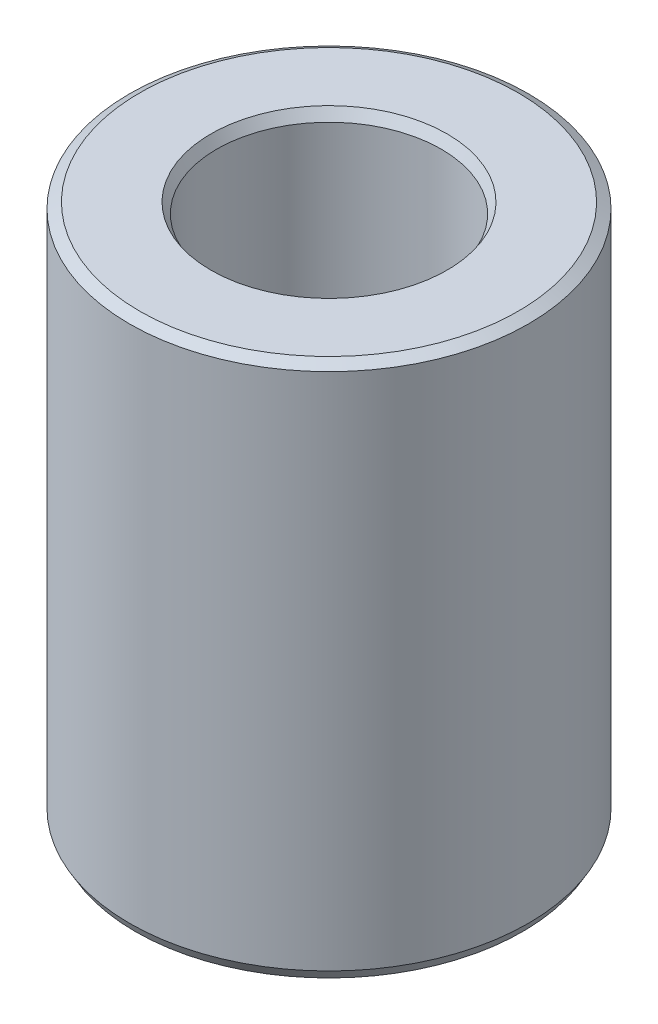
ISO-10303-21;
HEADER;
FILE_DESCRIPTION(('STEP AP214'),'2;1');
FILE_NAME('part.step','',(''),(''),'','','');
FILE_SCHEMA(('AUTOMOTIVE_DESIGN { 1 0 10303 214 1 1 1 1 }'));
ENDSEC;
DATA;
#1=APPLICATION_CONTEXT('core data for automotive mechanical design processes');
#2=APPLICATION_PROTOCOL_DEFINITION('international standard','automotive_design',2000,#1);
#3=PRODUCT_CONTEXT('',#1,'mechanical');
#4=PRODUCT('Part','Part','',(#3));
#5=PRODUCT_RELATED_PRODUCT_CATEGORY('part','',(#4));
#6=PRODUCT_DEFINITION_FORMATION('','',#4);
#7=PRODUCT_DEFINITION_CONTEXT('part definition',#1,'design');
#8=PRODUCT_DEFINITION('design','',#6,#7);
#9=PRODUCT_DEFINITION_SHAPE('','',#8);
#10=(LENGTH_UNIT() NAMED_UNIT(*) SI_UNIT(.MILLI.,.METRE.));
#11=(NAMED_UNIT(*) PLANE_ANGLE_UNIT() SI_UNIT($,.RADIAN.));
#12=(NAMED_UNIT(*) SI_UNIT($,.STERADIAN.) SOLID_ANGLE_UNIT());
#13=UNCERTAINTY_MEASURE_WITH_UNIT(LENGTH_MEASURE(1.E-05),#10,'distance_accuracy_value','');
#14=(GEOMETRIC_REPRESENTATION_CONTEXT(3) GLOBAL_UNCERTAINTY_ASSIGNED_CONTEXT((#13)) GLOBAL_UNIT_ASSIGNED_CONTEXT((#10,
#11,#12)) REPRESENTATION_CONTEXT('',''));
#15=CARTESIAN_POINT('',(0.,0.,0.));
#16=DIRECTION('',(0.,0.,1.));
#17=DIRECTION('',(1.,0.,0.));
#18=AXIS2_PLACEMENT_3D('',#15,#16,#17);
#19=CARTESIAN_POINT('',(0.,147.592695688174,0.));
#20=DIRECTION('',(0.,-1.,0.));
#21=DIRECTION('',(0.,0.,-1.));
#22=AXIS2_PLACEMENT_3D('',#19,#20,#21);
#23=CYLINDRICAL_SURFACE('',#22,55.);
#24=CARTESIAN_POINT('',(0.,2.81835768022978,0.));
#25=DIRECTION('',(0.,1.,0.));
#26=DIRECTION('',(0.,0.,1.));
#27=AXIS2_PLACEMENT_3D('',#24,#25,#26);
#28=CIRCLE('',#27,55.);
#29=CARTESIAN_POINT('',(0.,2.81835768022978,55.));
#30=VERTEX_POINT('',#29);
#31=EDGE_CURVE('E10',#30,#30,#28,.T.);
#32=ORIENTED_EDGE('',*,*,#31,.T.);
#33=EDGE_LOOP('',(#32));
#34=FACE_BOUND('',#33,.T.);
#35=CARTESIAN_POINT('',(0.,145.965516122821,0.));
#36=DIRECTION('',(0.,1.,0.));
#37=DIRECTION('',(0.,0.,1.));
#38=AXIS2_PLACEMENT_3D('',#35,#36,#37);
#39=CIRCLE('',#38,55.);
#40=CARTESIAN_POINT('',(0.,145.965516122821,55.));
#41=VERTEX_POINT('',#40);
#42=EDGE_CURVE('E50',#41,#41,#39,.F.);
#43=ORIENTED_EDGE('',*,*,#42,.T.);
#44=EDGE_LOOP('',(#43));
#45=FACE_BOUND('',#44,.T.);
#46=ADVANCED_FACE('F39',(#34,#45),#23,.T.);
#47=CARTESIAN_POINT('',(0.,147.592695688174,0.));
#48=DIRECTION('',(0.,1.,0.));
#49=DIRECTION('',(0.,0.,1.));
#50=AXIS2_PLACEMENT_3D('',#47,#48,#49);
#51=PLANE('',#50);
#52=CARTESIAN_POINT('',(0.,147.592695688174,0.));
#53=DIRECTION('',(0.,1.,0.));
#54=DIRECTION('',(0.,0.,1.));
#55=AXIS2_PLACEMENT_3D('',#52,#53,#54);
#56=CIRCLE('',#55,32.5723817013302);
#57=CARTESIAN_POINT('',(0.,147.592695688174,32.5723817013302));
#58=VERTEX_POINT('',#57);
#59=EDGE_CURVE('E58',#58,#58,#56,.F.);
#60=ORIENTED_EDGE('',*,*,#59,.T.);
#61=EDGE_LOOP('',(#60));
#62=FACE_BOUND('',#61,.T.);
#63=CARTESIAN_POINT('',(0.,147.592695688174,0.));
#64=DIRECTION('',(0.,1.,0.));
#65=DIRECTION('',(0.,0.,1.));
#66=AXIS2_PLACEMENT_3D('',#63,#64,#65);
#67=CIRCLE('',#66,52.1816423197702);
#68=CARTESIAN_POINT('',(0.,147.592695688174,52.1816423197702));
#69=VERTEX_POINT('',#68);
#70=EDGE_CURVE('E61',#69,#69,#67,.T.);
#71=ORIENTED_EDGE('',*,*,#70,.T.);
#72=EDGE_LOOP('',(#71));
#73=FACE_BOUND('',#72,.T.);
#74=ADVANCED_FACE('F88',(#62,#73),#51,.T.);
#75=CARTESIAN_POINT('',(0.,0.,0.));
#76=DIRECTION('',(0.,1.,0.));
#77=DIRECTION('',(0.,0.,1.));
#78=AXIS2_PLACEMENT_3D('',#75,#76,#77);
#79=PLANE('',#78);
#80=CARTESIAN_POINT('',(0.,0.,0.));
#81=DIRECTION('',(0.,1.,0.));
#82=DIRECTION('',(0.,0.,1.));
#83=AXIS2_PLACEMENT_3D('',#80,#81,#82);
#84=CIRCLE('',#83,33.7635598162067);
#85=CARTESIAN_POINT('',(0.,0.,33.7635598162067));
#86=VERTEX_POINT('',#85);
#87=EDGE_CURVE('E51',#86,#86,#84,.T.);
#88=ORIENTED_EDGE('',*,*,#87,.T.);
#89=EDGE_LOOP('',(#88));
#90=FACE_BOUND('',#89,.T.);
#91=CARTESIAN_POINT('',(0.,0.,0.));
#92=DIRECTION('',(0.,1.,0.));
#93=DIRECTION('',(0.,0.,1.));
#94=AXIS2_PLACEMENT_3D('',#91,#92,#93);
#95=CIRCLE('',#94,53.3728204346467);
#96=CARTESIAN_POINT('',(0.,0.,53.3728204346467));
#97=VERTEX_POINT('',#96);
#98=EDGE_CURVE('E54',#97,#97,#95,.F.);
#99=ORIENTED_EDGE('',*,*,#98,.T.);
#100=EDGE_LOOP('',(#99));
#101=FACE_BOUND('',#100,.T.);
#102=ADVANCED_FACE('F83',(#90,#101),#79,.F.);
#103=CARTESIAN_POINT('',(0.,147.592695688174,0.));
#104=DIRECTION('',(0.,-1.,0.));
#105=DIRECTION('',(0.,0.,-1.));
#106=AXIS2_PLACEMENT_3D('',#103,#104,#105);
#107=CYLINDRICAL_SURFACE('',#106,30.9452021359769);
#108=CARTESIAN_POINT('',(0.,144.774338007945,0.));
#109=DIRECTION('',(0.,1.,0.));
#110=DIRECTION('',(0.,0.,1.));
#111=AXIS2_PLACEMENT_3D('',#108,#109,#110);
#112=CIRCLE('',#111,30.9452021359769);
#113=CARTESIAN_POINT('',(0.,144.774338007945,30.9452021359769));
#114=VERTEX_POINT('',#113);
#115=EDGE_CURVE('E67',#114,#114,#112,.T.);
#116=ORIENTED_EDGE('',*,*,#115,.T.);
#117=EDGE_LOOP('',(#116));
#118=FACE_BOUND('',#117,.T.);
#119=CARTESIAN_POINT('',(0.,1.62717956535335,0.));
#120=DIRECTION('',(0.,1.,0.));
#121=DIRECTION('',(0.,0.,1.));
#122=AXIS2_PLACEMENT_3D('',#119,#120,#121);
#123=CIRCLE('',#122,30.9452021359769);
#124=CARTESIAN_POINT('',(0.,1.62717956535335,30.9452021359769));
#125=VERTEX_POINT('',#124);
#126=EDGE_CURVE('E69',#125,#125,#123,.F.);
#127=ORIENTED_EDGE('',*,*,#126,.T.);
#128=EDGE_LOOP('',(#127));
#129=FACE_BOUND('',#128,.T.);
#130=ADVANCED_FACE('F71',(#118,#129),#107,.F.);
#131=CARTESIAN_POINT('',(0.,144.774338007945,0.));
#132=DIRECTION('',(0.,1.,0.));
#133=DIRECTION('',(0.,0.,1.));
#134=AXIS2_PLACEMENT_3D('',#131,#132,#133);
#135=CONICAL_SURFACE('',#134,30.9452021359769,0.5235987755983);
#136=ORIENTED_EDGE('',*,*,#59,.F.);
#137=EDGE_LOOP('',(#136));
#138=FACE_BOUND('',#137,.T.);
#139=ORIENTED_EDGE('',*,*,#115,.F.);
#140=EDGE_LOOP('',(#139));
#141=FACE_BOUND('',#140,.T.);
#142=ADVANCED_FACE('F77',(#138,#141),#135,.F.);
#143=CARTESIAN_POINT('',(0.,0.,0.));
#144=DIRECTION('',(0.,-1.,0.));
#145=DIRECTION('',(0.,0.,-1.));
#146=AXIS2_PLACEMENT_3D('',#143,#144,#145);
#147=CONICAL_SURFACE('',#146,33.7635598162067,1.04719755119659);
#148=ORIENTED_EDGE('',*,*,#126,.F.);
#149=EDGE_LOOP('',(#148));
#150=FACE_BOUND('',#149,.T.);
#151=ORIENTED_EDGE('',*,*,#87,.F.);
#152=EDGE_LOOP('',(#151));
#153=FACE_BOUND('',#152,.T.);
#154=ADVANCED_FACE('F73',(#150,#153),#147,.F.);
#155=CARTESIAN_POINT('',(0.,2.81835768022978,0.));
#156=DIRECTION('',(0.,1.,0.));
#157=DIRECTION('',(0.,0.,1.));
#158=AXIS2_PLACEMENT_3D('',#155,#156,#157);
#159=CONICAL_SURFACE('',#158,55.,0.523598775598304);
#160=ORIENTED_EDGE('',*,*,#98,.F.);
#161=EDGE_LOOP('',(#160));
#162=FACE_BOUND('',#161,.T.);
#163=ORIENTED_EDGE('',*,*,#31,.F.);
#164=EDGE_LOOP('',(#163));
#165=FACE_BOUND('',#164,.T.);
#166=ADVANCED_FACE('F76',(#162,#165),#159,.T.);
#167=CARTESIAN_POINT('',(0.,147.592695688174,0.));
#168=DIRECTION('',(0.,-1.,0.));
#169=DIRECTION('',(0.,0.,-1.));
#170=AXIS2_PLACEMENT_3D('',#167,#168,#169);
#171=CONICAL_SURFACE('',#170,52.1816423197702,1.04719755119658);
#172=ORIENTED_EDGE('',*,*,#42,.F.);
#173=EDGE_LOOP('',(#172));
#174=FACE_BOUND('',#173,.T.);
#175=ORIENTED_EDGE('',*,*,#70,.F.);
#176=EDGE_LOOP('',(#175));
#177=FACE_BOUND('',#176,.T.);
#178=ADVANCED_FACE('F45',(#174,#177),#171,.T.);
#179=CLOSED_SHELL('',(#46,#74,#102,#130,#142,#154,#166,#178));
#180=MANIFOLD_SOLID_BREP('B2',#179);
#181=ADVANCED_BREP_SHAPE_REPRESENTATION('',(#18,#180),#14);
#182=SHAPE_DEFINITION_REPRESENTATION(#9,#181);
ENDSEC;
END-ISO-10303-21;
